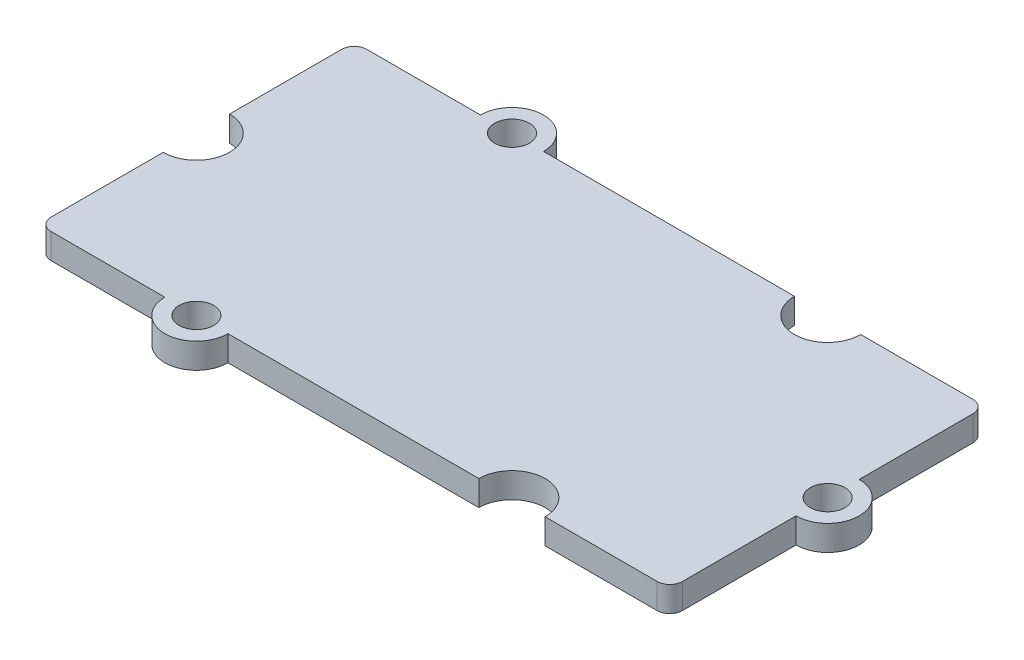
ISO-10303-21;
HEADER;
FILE_DESCRIPTION(('STEP AP214'),'2;1');
FILE_NAME('part.step','',(''),(''),'','','');
FILE_SCHEMA(('AUTOMOTIVE_DESIGN { 1 0 10303 214 1 1 1 1 }'));
ENDSEC;
DATA;
#1=APPLICATION_CONTEXT('core data for automotive mechanical design processes');
#2=APPLICATION_PROTOCOL_DEFINITION('international standard','automotive_design',2000,#1);
#3=PRODUCT_CONTEXT('',#1,'mechanical');
#4=PRODUCT('Part','Part','',(#3));
#5=PRODUCT_RELATED_PRODUCT_CATEGORY('part','',(#4));
#6=PRODUCT_DEFINITION_FORMATION('','',#4);
#7=PRODUCT_DEFINITION_CONTEXT('part definition',#1,'design');
#8=PRODUCT_DEFINITION('design','',#6,#7);
#9=PRODUCT_DEFINITION_SHAPE('','',#8);
#10=(LENGTH_UNIT() NAMED_UNIT(*) SI_UNIT(.MILLI.,.METRE.));
#11=(NAMED_UNIT(*) PLANE_ANGLE_UNIT() SI_UNIT($,.RADIAN.));
#12=(NAMED_UNIT(*) SI_UNIT($,.STERADIAN.) SOLID_ANGLE_UNIT());
#13=UNCERTAINTY_MEASURE_WITH_UNIT(LENGTH_MEASURE(1.E-05),#10,'distance_accuracy_value','');
#14=(GEOMETRIC_REPRESENTATION_CONTEXT(3) GLOBAL_UNCERTAINTY_ASSIGNED_CONTEXT((#13)) GLOBAL_UNIT_ASSIGNED_CONTEXT((#10,
#11,#12)) REPRESENTATION_CONTEXT('',''));
#15=CARTESIAN_POINT('',(0.,0.,0.));
#16=DIRECTION('',(0.,0.,1.));
#17=DIRECTION('',(1.,0.,0.));
#18=AXIS2_PLACEMENT_3D('',#15,#16,#17);
#19=CARTESIAN_POINT('',(20.,0.8,0.));
#20=DIRECTION('',(0.,-1.,0.));
#21=DIRECTION('',(0.,0.,-1.));
#22=AXIS2_PLACEMENT_3D('',#19,#20,#21);
#23=CYLINDRICAL_SURFACE('',#22,2.);
#24=CARTESIAN_POINT('',(20.,-0.8,0.));
#25=DIRECTION('',(0.,1.,0.));
#26=DIRECTION('',(0.,0.,1.));
#27=AXIS2_PLACEMENT_3D('',#24,#25,#26);
#28=CIRCLE('',#27,2.);
#29=CARTESIAN_POINT('',(20.,-0.8,2.00000000000001));
#30=VERTEX_POINT('',#29);
#31=CARTESIAN_POINT('',(20.,-0.8,-2.));
#32=VERTEX_POINT('',#31);
#33=EDGE_CURVE('E218',#30,#32,#28,.T.);
#34=ORIENTED_EDGE('',*,*,#33,.T.);
#35=DIRECTION('',(0.,-1.,0.));
#36=VECTOR('',#35,1.);
#37=CARTESIAN_POINT('',(20.,0.8,-2.));
#38=LINE('',#37,#36);
#39=CARTESIAN_POINT('',(20.,0.8,-2.));
#40=VERTEX_POINT('',#39);
#41=EDGE_CURVE('E11',#40,#32,#38,.T.);
#42=ORIENTED_EDGE('',*,*,#41,.F.);
#43=CARTESIAN_POINT('',(20.,0.8,0.));
#44=DIRECTION('',(0.,1.,0.));
#45=DIRECTION('',(0.,0.,1.));
#46=AXIS2_PLACEMENT_3D('',#43,#44,#45);
#47=CIRCLE('',#46,2.);
#48=CARTESIAN_POINT('',(20.,0.8,2.00000000000001));
#49=VERTEX_POINT('',#48);
#50=EDGE_CURVE('E269',#49,#40,#47,.T.);
#51=ORIENTED_EDGE('',*,*,#50,.F.);
#52=DIRECTION('',(0.,-1.,0.));
#53=VECTOR('',#52,1.);
#54=CARTESIAN_POINT('',(20.,0.8,2.00000000000001));
#55=LINE('',#54,#53);
#56=EDGE_CURVE('E217',#49,#30,#55,.T.);
#57=ORIENTED_EDGE('',*,*,#56,.T.);
#58=EDGE_LOOP('',(#34,#42,#51,#57));
#59=FACE_BOUND('',#58,.T.);
#60=ADVANCED_FACE('F38',(#59),#23,.T.);
#61=CARTESIAN_POINT('',(20.,0.8,0.));
#62=DIRECTION('',(-1.,0.,0.));
#63=DIRECTION('',(0.,0.,1.));
#64=AXIS2_PLACEMENT_3D('',#61,#62,#63);
#65=PLANE('',#64);
#66=DIRECTION('',(0.,0.,-1.));
#67=VECTOR('',#66,1.);
#68=CARTESIAN_POINT('',(20.,-0.8,0.));
#69=LINE('',#68,#67);
#70=CARTESIAN_POINT('',(20.,-0.8,-9.19999999999999));
#71=VERTEX_POINT('',#70);
#72=EDGE_CURVE('E221',#32,#71,#69,.T.);
#73=ORIENTED_EDGE('',*,*,#72,.T.);
#74=DIRECTION('',(0.,-1.,0.));
#75=VECTOR('',#74,1.);
#76=CARTESIAN_POINT('',(20.,0.8,-9.19999999999999));
#77=LINE('',#76,#75);
#78=CARTESIAN_POINT('',(20.,0.8,-9.19999999999999));
#79=VERTEX_POINT('',#78);
#80=EDGE_CURVE('E46',#79,#71,#77,.T.);
#81=ORIENTED_EDGE('',*,*,#80,.F.);
#82=DIRECTION('',(0.,0.,-1.));
#83=VECTOR('',#82,1.);
#84=CARTESIAN_POINT('',(20.,0.8,0.));
#85=LINE('',#84,#83);
#86=EDGE_CURVE('E133',#40,#79,#85,.T.);
#87=ORIENTED_EDGE('',*,*,#86,.F.);
#88=ORIENTED_EDGE('',*,*,#41,.T.);
#89=EDGE_LOOP('',(#73,#81,#87,#88));
#90=FACE_BOUND('',#89,.T.);
#91=ADVANCED_FACE('F308',(#90),#65,.F.);
#92=CARTESIAN_POINT('',(19.2,0.8,-9.19999999999999));
#93=DIRECTION('',(0.,-1.,0.));
#94=DIRECTION('',(0.,0.,-1.));
#95=AXIS2_PLACEMENT_3D('',#92,#93,#94);
#96=CYLINDRICAL_SURFACE('',#95,0.800000000000002);
#97=CARTESIAN_POINT('',(19.2,-0.8,-9.19999999999999));
#98=DIRECTION('',(0.,1.,0.));
#99=DIRECTION('',(0.,0.,1.));
#100=AXIS2_PLACEMENT_3D('',#97,#98,#99);
#101=CIRCLE('',#100,0.800000000000002);
#102=CARTESIAN_POINT('',(19.2,-0.8,-9.99999999999999));
#103=VERTEX_POINT('',#102);
#104=EDGE_CURVE('E224',#103,#71,#101,.F.);
#105=ORIENTED_EDGE('',*,*,#104,.F.);
#106=DIRECTION('',(0.,-1.,0.));
#107=VECTOR('',#106,1.);
#108=CARTESIAN_POINT('',(19.2,0.8,-9.99999999999999));
#109=LINE('',#108,#107);
#110=CARTESIAN_POINT('',(19.2,0.8,-9.99999999999999));
#111=VERTEX_POINT('',#110);
#112=EDGE_CURVE('E301',#111,#103,#109,.T.);
#113=ORIENTED_EDGE('',*,*,#112,.F.);
#114=CARTESIAN_POINT('',(19.2,0.8,-9.19999999999999));
#115=DIRECTION('',(0.,1.,0.));
#116=DIRECTION('',(0.,0.,1.));
#117=AXIS2_PLACEMENT_3D('',#114,#115,#116);
#118=CIRCLE('',#117,0.800000000000002);
#119=EDGE_CURVE('E307',#111,#79,#118,.F.);
#120=ORIENTED_EDGE('',*,*,#119,.T.);
#121=ORIENTED_EDGE('',*,*,#80,.T.);
#122=EDGE_LOOP('',(#105,#113,#120,#121));
#123=FACE_BOUND('',#122,.T.);
#124=ADVANCED_FACE('F305',(#123),#96,.T.);
#125=CARTESIAN_POINT('',(0.,0.8,-9.99999999999999));
#126=DIRECTION('',(0.,0.,-1.));
#127=DIRECTION('',(-1.,0.,0.));
#128=AXIS2_PLACEMENT_3D('',#125,#126,#127);
#129=PLANE('',#128);
#130=DIRECTION('',(1.,0.,0.));
#131=VECTOR('',#130,1.);
#132=CARTESIAN_POINT('',(0.,-0.8,-9.99999999999999));
#133=LINE('',#132,#131);
#134=CARTESIAN_POINT('',(12.1,-0.8,-9.99999999999999));
#135=VERTEX_POINT('',#134);
#136=EDGE_CURVE('E227',#135,#103,#133,.T.);
#137=ORIENTED_EDGE('',*,*,#136,.F.);
#138=DIRECTION('',(0.,-1.,0.));
#139=VECTOR('',#138,1.);
#140=CARTESIAN_POINT('',(12.1,0.8,-9.99999999999999));
#141=LINE('',#140,#139);
#142=CARTESIAN_POINT('',(12.1,0.8,-9.99999999999999));
#143=VERTEX_POINT('',#142);
#144=EDGE_CURVE('E299',#143,#135,#141,.T.);
#145=ORIENTED_EDGE('',*,*,#144,.F.);
#146=DIRECTION('',(1.,0.,0.));
#147=VECTOR('',#146,1.);
#148=CARTESIAN_POINT('',(0.,0.8,-9.99999999999999));
#149=LINE('',#148,#147);
#150=EDGE_CURVE('E321',#143,#111,#149,.T.);
#151=ORIENTED_EDGE('',*,*,#150,.T.);
#152=ORIENTED_EDGE('',*,*,#112,.T.);
#153=EDGE_LOOP('',(#137,#145,#151,#152));
#154=FACE_BOUND('',#153,.T.);
#155=ADVANCED_FACE('F318',(#154),#129,.T.);
#156=CARTESIAN_POINT('',(10.,0.8,-9.99999999999999));
#157=DIRECTION('',(0.,-1.,0.));
#158=DIRECTION('',(0.,0.,-1.));
#159=AXIS2_PLACEMENT_3D('',#156,#157,#158);
#160=CYLINDRICAL_SURFACE('',#159,2.1);
#161=CARTESIAN_POINT('',(10.,-0.8,-9.99999999999999));
#162=DIRECTION('',(0.,1.,0.));
#163=DIRECTION('',(0.,0.,1.));
#164=AXIS2_PLACEMENT_3D('',#161,#162,#163);
#165=CIRCLE('',#164,2.1);
#166=CARTESIAN_POINT('',(7.9,-0.8,-9.99999999999999));
#167=VERTEX_POINT('',#166);
#168=EDGE_CURVE('E230',#167,#135,#165,.T.);
#169=ORIENTED_EDGE('',*,*,#168,.F.);
#170=DIRECTION('',(0.,-1.,0.));
#171=VECTOR('',#170,1.);
#172=CARTESIAN_POINT('',(7.9,0.8,-9.99999999999999));
#173=LINE('',#172,#171);
#174=CARTESIAN_POINT('',(7.9,0.8,-9.99999999999999));
#175=VERTEX_POINT('',#174);
#176=EDGE_CURVE('E297',#175,#167,#173,.T.);
#177=ORIENTED_EDGE('',*,*,#176,.F.);
#178=CARTESIAN_POINT('',(10.,0.8,-9.99999999999999));
#179=DIRECTION('',(0.,1.,0.));
#180=DIRECTION('',(0.,0.,1.));
#181=AXIS2_PLACEMENT_3D('',#178,#179,#180);
#182=CIRCLE('',#181,2.1);
#183=EDGE_CURVE('E325',#175,#143,#182,.T.);
#184=ORIENTED_EDGE('',*,*,#183,.T.);
#185=ORIENTED_EDGE('',*,*,#144,.T.);
#186=EDGE_LOOP('',(#169,#177,#184,#185));
#187=FACE_BOUND('',#186,.T.);
#188=ADVANCED_FACE('F403',(#187),#160,.F.);
#189=CARTESIAN_POINT('',(-8.,-0.8,-9.99999999999999));
#190=VERTEX_POINT('',#189);
#191=EDGE_CURVE('E232',#190,#167,#133,.T.);
#192=ORIENTED_EDGE('',*,*,#191,.F.);
#193=DIRECTION('',(0.,-1.,0.));
#194=VECTOR('',#193,1.);
#195=CARTESIAN_POINT('',(-8.,0.8,-9.99999999999999));
#196=LINE('',#195,#194);
#197=CARTESIAN_POINT('',(-8.,0.8,-9.99999999999999));
#198=VERTEX_POINT('',#197);
#199=EDGE_CURVE('E295',#198,#190,#196,.T.);
#200=ORIENTED_EDGE('',*,*,#199,.F.);
#201=EDGE_CURVE('E328',#198,#175,#149,.T.);
#202=ORIENTED_EDGE('',*,*,#201,.T.);
#203=ORIENTED_EDGE('',*,*,#176,.T.);
#204=EDGE_LOOP('',(#192,#200,#202,#203));
#205=FACE_BOUND('',#204,.T.);
#206=ADVANCED_FACE('F398',(#205),#129,.T.);
#207=CARTESIAN_POINT('',(-10.,0.8,-9.99999999999999));
#208=DIRECTION('',(0.,-1.,0.));
#209=DIRECTION('',(0.,0.,-1.));
#210=AXIS2_PLACEMENT_3D('',#207,#208,#209);
#211=CYLINDRICAL_SURFACE('',#210,2.);
#212=CARTESIAN_POINT('',(-10.,-0.8,-9.99999999999999));
#213=DIRECTION('',(0.,1.,0.));
#214=DIRECTION('',(0.,0.,1.));
#215=AXIS2_PLACEMENT_3D('',#212,#213,#214);
#216=CIRCLE('',#215,2.);
#217=CARTESIAN_POINT('',(-12.,-0.8,-9.99999999999999));
#218=VERTEX_POINT('',#217);
#219=EDGE_CURVE('E235',#190,#218,#216,.T.);
#220=ORIENTED_EDGE('',*,*,#219,.T.);
#221=DIRECTION('',(0.,-1.,0.));
#222=VECTOR('',#221,1.);
#223=CARTESIAN_POINT('',(-12.,0.8,-9.99999999999999));
#224=LINE('',#223,#222);
#225=CARTESIAN_POINT('',(-12.,0.8,-9.99999999999999));
#226=VERTEX_POINT('',#225);
#227=EDGE_CURVE('E293',#226,#218,#224,.T.);
#228=ORIENTED_EDGE('',*,*,#227,.F.);
#229=CARTESIAN_POINT('',(-10.,0.8,-9.99999999999999));
#230=DIRECTION('',(0.,1.,0.));
#231=DIRECTION('',(0.,0.,1.));
#232=AXIS2_PLACEMENT_3D('',#229,#230,#231);
#233=CIRCLE('',#232,2.);
#234=EDGE_CURVE('E332',#198,#226,#233,.T.);
#235=ORIENTED_EDGE('',*,*,#234,.F.);
#236=ORIENTED_EDGE('',*,*,#199,.T.);
#237=EDGE_LOOP('',(#220,#228,#235,#236));
#238=FACE_BOUND('',#237,.T.);
#239=ADVANCED_FACE('F405',(#238),#211,.T.);
#240=CARTESIAN_POINT('',(-19.2,-0.8,-9.99999999999999));
#241=VERTEX_POINT('',#240);
#242=EDGE_CURVE('E231',#241,#218,#133,.T.);
#243=ORIENTED_EDGE('',*,*,#242,.F.);
#244=DIRECTION('',(0.,-1.,0.));
#245=VECTOR('',#244,1.);
#246=CARTESIAN_POINT('',(-19.2,0.8,-9.99999999999999));
#247=LINE('',#246,#245);
#248=CARTESIAN_POINT('',(-19.2,0.8,-9.99999999999999));
#249=VERTEX_POINT('',#248);
#250=EDGE_CURVE('E291',#249,#241,#247,.T.);
#251=ORIENTED_EDGE('',*,*,#250,.F.);
#252=EDGE_CURVE('E327',#249,#226,#149,.T.);
#253=ORIENTED_EDGE('',*,*,#252,.T.);
#254=ORIENTED_EDGE('',*,*,#227,.T.);
#255=EDGE_LOOP('',(#243,#251,#253,#254));
#256=FACE_BOUND('',#255,.T.);
#257=ADVANCED_FACE('F394',(#256),#129,.T.);
#258=CARTESIAN_POINT('',(-19.2,0.8,-9.19999999999999));
#259=DIRECTION('',(0.,-1.,0.));
#260=DIRECTION('',(0.,0.,-1.));
#261=AXIS2_PLACEMENT_3D('',#258,#259,#260);
#262=CYLINDRICAL_SURFACE('',#261,0.8);
#263=CARTESIAN_POINT('',(-19.2,-0.8,-9.19999999999999));
#264=DIRECTION('',(0.,1.,0.));
#265=DIRECTION('',(0.,0.,1.));
#266=AXIS2_PLACEMENT_3D('',#263,#264,#265);
#267=CIRCLE('',#266,0.8);
#268=CARTESIAN_POINT('',(-20.,-0.8,-9.19999999999999));
#269=VERTEX_POINT('',#268);
#270=EDGE_CURVE('E238',#269,#241,#267,.F.);
#271=ORIENTED_EDGE('',*,*,#270,.F.);
#272=DIRECTION('',(0.,-1.,0.));
#273=VECTOR('',#272,1.);
#274=CARTESIAN_POINT('',(-20.,0.8,-9.19999999999999));
#275=LINE('',#274,#273);
#276=CARTESIAN_POINT('',(-20.,0.8,-9.19999999999999));
#277=VERTEX_POINT('',#276);
#278=EDGE_CURVE('E289',#277,#269,#275,.T.);
#279=ORIENTED_EDGE('',*,*,#278,.F.);
#280=CARTESIAN_POINT('',(-19.2,0.8,-9.19999999999999));
#281=DIRECTION('',(0.,1.,0.));
#282=DIRECTION('',(0.,0.,1.));
#283=AXIS2_PLACEMENT_3D('',#280,#281,#282);
#284=CIRCLE('',#283,0.8);
#285=EDGE_CURVE('E334',#277,#249,#284,.F.);
#286=ORIENTED_EDGE('',*,*,#285,.T.);
#287=ORIENTED_EDGE('',*,*,#250,.T.);
#288=EDGE_LOOP('',(#271,#279,#286,#287));
#289=FACE_BOUND('',#288,.T.);
#290=ADVANCED_FACE('F389',(#289),#262,.T.);
#291=CARTESIAN_POINT('',(-20.,0.8,0.));
#292=DIRECTION('',(-1.,0.,0.));
#293=DIRECTION('',(0.,0.,1.));
#294=AXIS2_PLACEMENT_3D('',#291,#292,#293);
#295=PLANE('',#294);
#296=DIRECTION('',(0.,0.,-1.));
#297=VECTOR('',#296,1.);
#298=CARTESIAN_POINT('',(-20.,-0.8,0.));
#299=LINE('',#298,#297);
#300=CARTESIAN_POINT('',(-20.,-0.8,-2.09999999999999));
#301=VERTEX_POINT('',#300);
#302=EDGE_CURVE('E241',#301,#269,#299,.T.);
#303=ORIENTED_EDGE('',*,*,#302,.F.);
#304=DIRECTION('',(0.,-1.,0.));
#305=VECTOR('',#304,1.);
#306=CARTESIAN_POINT('',(-20.,0.8,-2.09999999999999));
#307=LINE('',#306,#305);
#308=CARTESIAN_POINT('',(-20.,0.8,-2.09999999999999));
#309=VERTEX_POINT('',#308);
#310=EDGE_CURVE('E287',#309,#301,#307,.T.);
#311=ORIENTED_EDGE('',*,*,#310,.F.);
#312=DIRECTION('',(0.,0.,-1.));
#313=VECTOR('',#312,1.);
#314=CARTESIAN_POINT('',(-20.,0.8,0.));
#315=LINE('',#314,#313);
#316=EDGE_CURVE('E337',#309,#277,#315,.T.);
#317=ORIENTED_EDGE('',*,*,#316,.T.);
#318=ORIENTED_EDGE('',*,*,#278,.T.);
#319=EDGE_LOOP('',(#303,#311,#317,#318));
#320=FACE_BOUND('',#319,.T.);
#321=ADVANCED_FACE('F383',(#320),#295,.T.);
#322=CARTESIAN_POINT('',(-20.,0.8,0.));
#323=DIRECTION('',(0.,-1.,0.));
#324=DIRECTION('',(0.,0.,-1.));
#325=AXIS2_PLACEMENT_3D('',#322,#323,#324);
#326=CYLINDRICAL_SURFACE('',#325,2.1);
#327=CARTESIAN_POINT('',(-20.,-0.8,0.));
#328=DIRECTION('',(0.,1.,0.));
#329=DIRECTION('',(0.,0.,1.));
#330=AXIS2_PLACEMENT_3D('',#327,#328,#329);
#331=CIRCLE('',#330,2.1);
#332=CARTESIAN_POINT('',(-20.,-0.8,2.10000000000001));
#333=VERTEX_POINT('',#332);
#334=EDGE_CURVE('E244',#333,#301,#331,.T.);
#335=ORIENTED_EDGE('',*,*,#334,.F.);
#336=DIRECTION('',(0.,-1.,0.));
#337=VECTOR('',#336,1.);
#338=CARTESIAN_POINT('',(-20.,0.8,2.10000000000001));
#339=LINE('',#338,#337);
#340=CARTESIAN_POINT('',(-20.,0.8,2.10000000000001));
#341=VERTEX_POINT('',#340);
#342=EDGE_CURVE('E285',#341,#333,#339,.T.);
#343=ORIENTED_EDGE('',*,*,#342,.F.);
#344=CARTESIAN_POINT('',(-20.,0.8,0.));
#345=DIRECTION('',(0.,1.,0.));
#346=DIRECTION('',(0.,0.,1.));
#347=AXIS2_PLACEMENT_3D('',#344,#345,#346);
#348=CIRCLE('',#347,2.1);
#349=EDGE_CURVE('E340',#341,#309,#348,.T.);
#350=ORIENTED_EDGE('',*,*,#349,.T.);
#351=ORIENTED_EDGE('',*,*,#310,.T.);
#352=EDGE_LOOP('',(#335,#343,#350,#351));
#353=FACE_BOUND('',#352,.T.);
#354=ADVANCED_FACE('F379',(#353),#326,.F.);
#355=CARTESIAN_POINT('',(-20.,-0.8,9.20000000000001));
#356=VERTEX_POINT('',#355);
#357=EDGE_CURVE('E245',#356,#333,#299,.T.);
#358=ORIENTED_EDGE('',*,*,#357,.F.);
#359=DIRECTION('',(0.,-1.,0.));
#360=VECTOR('',#359,1.);
#361=CARTESIAN_POINT('',(-20.,0.8,9.20000000000001));
#362=LINE('',#361,#360);
#363=CARTESIAN_POINT('',(-20.,0.8,9.20000000000001));
#364=VERTEX_POINT('',#363);
#365=EDGE_CURVE('E283',#364,#356,#362,.T.);
#366=ORIENTED_EDGE('',*,*,#365,.F.);
#367=EDGE_CURVE('E341',#364,#341,#315,.T.);
#368=ORIENTED_EDGE('',*,*,#367,.T.);
#369=ORIENTED_EDGE('',*,*,#342,.T.);
#370=EDGE_LOOP('',(#358,#366,#368,#369));
#371=FACE_BOUND('',#370,.T.);
#372=ADVANCED_FACE('F374',(#371),#295,.T.);
#373=CARTESIAN_POINT('',(-19.2,0.8,9.20000000000001));
#374=DIRECTION('',(0.,-1.,0.));
#375=DIRECTION('',(0.,0.,-1.));
#376=AXIS2_PLACEMENT_3D('',#373,#374,#375);
#377=CYLINDRICAL_SURFACE('',#376,0.8);
#378=CARTESIAN_POINT('',(-19.2,-0.8,9.20000000000001));
#379=DIRECTION('',(0.,1.,0.));
#380=DIRECTION('',(0.,0.,1.));
#381=AXIS2_PLACEMENT_3D('',#378,#379,#380);
#382=CIRCLE('',#381,0.8);
#383=CARTESIAN_POINT('',(-19.2,-0.8,10.));
#384=VERTEX_POINT('',#383);
#385=EDGE_CURVE('E248',#384,#356,#382,.F.);
#386=ORIENTED_EDGE('',*,*,#385,.F.);
#387=DIRECTION('',(0.,-1.,0.));
#388=VECTOR('',#387,1.);
#389=CARTESIAN_POINT('',(-19.2,0.8,10.));
#390=LINE('',#389,#388);
#391=CARTESIAN_POINT('',(-19.2,0.8,10.));
#392=VERTEX_POINT('',#391);
#393=EDGE_CURVE('E281',#392,#384,#390,.T.);
#394=ORIENTED_EDGE('',*,*,#393,.F.);
#395=CARTESIAN_POINT('',(-19.2,0.8,9.20000000000001));
#396=DIRECTION('',(0.,1.,0.));
#397=DIRECTION('',(0.,0.,1.));
#398=AXIS2_PLACEMENT_3D('',#395,#396,#397);
#399=CIRCLE('',#398,0.8);
#400=EDGE_CURVE('E344',#392,#364,#399,.F.);
#401=ORIENTED_EDGE('',*,*,#400,.T.);
#402=ORIENTED_EDGE('',*,*,#365,.T.);
#403=EDGE_LOOP('',(#386,#394,#401,#402));
#404=FACE_BOUND('',#403,.T.);
#405=ADVANCED_FACE('F369',(#404),#377,.T.);
#406=CARTESIAN_POINT('',(0.,0.8,10.));
#407=DIRECTION('',(0.,0.,-1.));
#408=DIRECTION('',(-1.,0.,0.));
#409=AXIS2_PLACEMENT_3D('',#406,#407,#408);
#410=PLANE('',#409);
#411=DIRECTION('',(1.,0.,0.));
#412=VECTOR('',#411,1.);
#413=CARTESIAN_POINT('',(0.,-0.8,10.));
#414=LINE('',#413,#412);
#415=CARTESIAN_POINT('',(-12.,-0.8,10.));
#416=VERTEX_POINT('',#415);
#417=EDGE_CURVE('E251',#384,#416,#414,.T.);
#418=ORIENTED_EDGE('',*,*,#417,.T.);
#419=DIRECTION('',(0.,-1.,0.));
#420=VECTOR('',#419,1.);
#421=CARTESIAN_POINT('',(-12.,0.8,10.));
#422=LINE('',#421,#420);
#423=CARTESIAN_POINT('',(-12.,0.8,10.));
#424=VERTEX_POINT('',#423);
#425=EDGE_CURVE('E278',#424,#416,#422,.T.);
#426=ORIENTED_EDGE('',*,*,#425,.F.);
#427=DIRECTION('',(1.,0.,0.));
#428=VECTOR('',#427,1.);
#429=CARTESIAN_POINT('',(0.,0.8,10.));
#430=LINE('',#429,#428);
#431=EDGE_CURVE('E194',#392,#424,#430,.T.);
#432=ORIENTED_EDGE('',*,*,#431,.F.);
#433=ORIENTED_EDGE('',*,*,#393,.T.);
#434=EDGE_LOOP('',(#418,#426,#432,#433));
#435=FACE_BOUND('',#434,.T.);
#436=ADVANCED_FACE('F366',(#435),#410,.F.);
#437=CARTESIAN_POINT('',(-10.,0.8,10.));
#438=DIRECTION('',(0.,-1.,0.));
#439=DIRECTION('',(0.,0.,-1.));
#440=AXIS2_PLACEMENT_3D('',#437,#438,#439);
#441=CYLINDRICAL_SURFACE('',#440,2.);
#442=CARTESIAN_POINT('',(-10.,-0.8,10.));
#443=DIRECTION('',(0.,1.,0.));
#444=DIRECTION('',(0.,0.,1.));
#445=AXIS2_PLACEMENT_3D('',#442,#443,#444);
#446=CIRCLE('',#445,2.);
#447=CARTESIAN_POINT('',(-8.,-0.8,10.));
#448=VERTEX_POINT('',#447);
#449=EDGE_CURVE('E253',#416,#448,#446,.T.);
#450=ORIENTED_EDGE('',*,*,#449,.T.);
#451=DIRECTION('',(0.,-1.,0.));
#452=VECTOR('',#451,1.);
#453=CARTESIAN_POINT('',(-8.,0.8,10.));
#454=LINE('',#453,#452);
#455=CARTESIAN_POINT('',(-8.,0.8,10.));
#456=VERTEX_POINT('',#455);
#457=EDGE_CURVE('E275',#456,#448,#454,.T.);
#458=ORIENTED_EDGE('',*,*,#457,.F.);
#459=CARTESIAN_POINT('',(-10.,0.8,10.));
#460=DIRECTION('',(0.,1.,0.));
#461=DIRECTION('',(0.,0.,1.));
#462=AXIS2_PLACEMENT_3D('',#459,#460,#461);
#463=CIRCLE('',#462,2.);
#464=EDGE_CURVE('E346',#424,#456,#463,.T.);
#465=ORIENTED_EDGE('',*,*,#464,.F.);
#466=ORIENTED_EDGE('',*,*,#425,.T.);
#467=EDGE_LOOP('',(#450,#458,#465,#466));
#468=FACE_BOUND('',#467,.T.);
#469=ADVANCED_FACE('F362',(#468),#441,.T.);
#470=CARTESIAN_POINT('',(7.9,-0.8,10.));
#471=VERTEX_POINT('',#470);
#472=EDGE_CURVE('E254',#448,#471,#414,.T.);
#473=ORIENTED_EDGE('',*,*,#472,.T.);
#474=DIRECTION('',(0.,-1.,0.));
#475=VECTOR('',#474,1.);
#476=CARTESIAN_POINT('',(7.9,0.8,10.));
#477=LINE('',#476,#475);
#478=CARTESIAN_POINT('',(7.9,0.8,10.));
#479=VERTEX_POINT('',#478);
#480=EDGE_CURVE('E273',#479,#471,#477,.T.);
#481=ORIENTED_EDGE('',*,*,#480,.F.);
#482=EDGE_CURVE('E193',#456,#479,#430,.T.);
#483=ORIENTED_EDGE('',*,*,#482,.F.);
#484=ORIENTED_EDGE('',*,*,#457,.T.);
#485=EDGE_LOOP('',(#473,#481,#483,#484));
#486=FACE_BOUND('',#485,.T.);
#487=ADVANCED_FACE('F357',(#486),#410,.F.);
#488=CARTESIAN_POINT('',(10.,0.8,10.));
#489=DIRECTION('',(0.,-1.,0.));
#490=DIRECTION('',(0.,0.,-1.));
#491=AXIS2_PLACEMENT_3D('',#488,#489,#490);
#492=CYLINDRICAL_SURFACE('',#491,2.1);
#493=CARTESIAN_POINT('',(10.,-0.8,10.));
#494=DIRECTION('',(0.,1.,0.));
#495=DIRECTION('',(0.,0.,1.));
#496=AXIS2_PLACEMENT_3D('',#493,#494,#495);
#497=CIRCLE('',#496,2.1);
#498=CARTESIAN_POINT('',(12.1,-0.8,10.));
#499=VERTEX_POINT('',#498);
#500=EDGE_CURVE('E256',#499,#471,#497,.T.);
#501=ORIENTED_EDGE('',*,*,#500,.F.);
#502=DIRECTION('',(0.,-1.,0.));
#503=VECTOR('',#502,1.);
#504=CARTESIAN_POINT('',(12.1,0.8,10.));
#505=LINE('',#504,#503);
#506=CARTESIAN_POINT('',(12.1,0.8,10.));
#507=VERTEX_POINT('',#506);
#508=EDGE_CURVE('E199',#507,#499,#505,.T.);
#509=ORIENTED_EDGE('',*,*,#508,.F.);
#510=CARTESIAN_POINT('',(10.,0.8,10.));
#511=DIRECTION('',(0.,1.,0.));
#512=DIRECTION('',(0.,0.,1.));
#513=AXIS2_PLACEMENT_3D('',#510,#511,#512);
#514=CIRCLE('',#513,2.1);
#515=EDGE_CURVE('E190',#507,#479,#514,.T.);
#516=ORIENTED_EDGE('',*,*,#515,.T.);
#517=ORIENTED_EDGE('',*,*,#480,.T.);
#518=EDGE_LOOP('',(#501,#509,#516,#517));
#519=FACE_BOUND('',#518,.T.);
#520=ADVANCED_FACE('F353',(#519),#492,.F.);
#521=CARTESIAN_POINT('',(19.2,-0.8,10.));
#522=VERTEX_POINT('',#521);
#523=EDGE_CURVE('E198',#499,#522,#414,.T.);
#524=ORIENTED_EDGE('',*,*,#523,.T.);
#525=DIRECTION('',(0.,-1.,0.));
#526=VECTOR('',#525,1.);
#527=CARTESIAN_POINT('',(19.2,0.8,10.));
#528=LINE('',#527,#526);
#529=CARTESIAN_POINT('',(19.2,0.8,10.));
#530=VERTEX_POINT('',#529);
#531=EDGE_CURVE('E195',#530,#522,#528,.T.);
#532=ORIENTED_EDGE('',*,*,#531,.F.);
#533=EDGE_CURVE('E183',#507,#530,#430,.T.);
#534=ORIENTED_EDGE('',*,*,#533,.F.);
#535=ORIENTED_EDGE('',*,*,#508,.T.);
#536=EDGE_LOOP('',(#524,#532,#534,#535));
#537=FACE_BOUND('',#536,.T.);
#538=ADVANCED_FACE('F196',(#537),#410,.F.);
#539=CARTESIAN_POINT('',(19.2,0.8,9.20000000000001));
#540=DIRECTION('',(0.,-1.,0.));
#541=DIRECTION('',(0.,0.,-1.));
#542=AXIS2_PLACEMENT_3D('',#539,#540,#541);
#543=CYLINDRICAL_SURFACE('',#542,0.8);
#544=CARTESIAN_POINT('',(19.2,-0.8,9.20000000000001));
#545=DIRECTION('',(0.,1.,0.));
#546=DIRECTION('',(0.,0.,1.));
#547=AXIS2_PLACEMENT_3D('',#544,#545,#546);
#548=CIRCLE('',#547,0.8);
#549=CARTESIAN_POINT('',(20.,-0.8,9.20000000000001));
#550=VERTEX_POINT('',#549);
#551=EDGE_CURVE('E119',#522,#550,#548,.T.);
#552=ORIENTED_EDGE('',*,*,#551,.T.);
#553=DIRECTION('',(0.,-1.,0.));
#554=VECTOR('',#553,1.);
#555=CARTESIAN_POINT('',(20.,0.8,9.20000000000001));
#556=LINE('',#555,#554);
#557=CARTESIAN_POINT('',(20.,0.8,9.20000000000001));
#558=VERTEX_POINT('',#557);
#559=EDGE_CURVE('E200',#558,#550,#556,.T.);
#560=ORIENTED_EDGE('',*,*,#559,.F.);
#561=CARTESIAN_POINT('',(19.2,0.8,9.20000000000001));
#562=DIRECTION('',(0.,1.,0.));
#563=DIRECTION('',(0.,0.,1.));
#564=AXIS2_PLACEMENT_3D('',#561,#562,#563);
#565=CIRCLE('',#564,0.8);
#566=EDGE_CURVE('E188',#530,#558,#565,.T.);
#567=ORIENTED_EDGE('',*,*,#566,.F.);
#568=ORIENTED_EDGE('',*,*,#531,.T.);
#569=EDGE_LOOP('',(#552,#560,#567,#568));
#570=FACE_BOUND('',#569,.T.);
#571=ADVANCED_FACE('F202',(#570),#543,.T.);
#572=CARTESIAN_POINT('',(20.,0.8,0.));
#573=DIRECTION('',(0.,-1.,0.));
#574=DIRECTION('',(0.,0.,-1.));
#575=AXIS2_PLACEMENT_3D('',#572,#573,#574);
#576=CYLINDRICAL_SURFACE('',#575,1.1);
#577=CARTESIAN_POINT('',(20.,0.8,0.));
#578=DIRECTION('',(0.,1.,0.));
#579=DIRECTION('',(0.,0.,1.));
#580=AXIS2_PLACEMENT_3D('',#577,#578,#579);
#581=CIRCLE('',#580,1.1);
#582=CARTESIAN_POINT('',(20.,0.8,1.1));
#583=VERTEX_POINT('',#582);
#584=EDGE_CURVE('E211',#583,#583,#581,.T.);
#585=ORIENTED_EDGE('',*,*,#584,.T.);
#586=EDGE_LOOP('',(#585));
#587=FACE_BOUND('',#586,.T.);
#588=CARTESIAN_POINT('',(20.,-0.8,0.));
#589=DIRECTION('',(0.,1.,0.));
#590=DIRECTION('',(0.,0.,1.));
#591=AXIS2_PLACEMENT_3D('',#588,#589,#590);
#592=CIRCLE('',#591,1.1);
#593=CARTESIAN_POINT('',(20.,-0.8,1.1));
#594=VERTEX_POINT('',#593);
#595=EDGE_CURVE('E263',#594,#594,#592,.T.);
#596=ORIENTED_EDGE('',*,*,#595,.F.);
#597=EDGE_LOOP('',(#596));
#598=FACE_BOUND('',#597,.T.);
#599=ADVANCED_FACE('F431',(#587,#598),#576,.F.);
#600=CARTESIAN_POINT('',(-10.,0.8,-9.99999999999999));
#601=DIRECTION('',(0.,-1.,0.));
#602=DIRECTION('',(0.,0.,-1.));
#603=AXIS2_PLACEMENT_3D('',#600,#601,#602);
#604=CYLINDRICAL_SURFACE('',#603,1.1);
#605=CARTESIAN_POINT('',(-10.,0.8,-9.99999999999999));
#606=DIRECTION('',(0.,1.,0.));
#607=DIRECTION('',(0.,0.,1.));
#608=AXIS2_PLACEMENT_3D('',#605,#606,#607);
#609=CIRCLE('',#608,1.1);
#610=CARTESIAN_POINT('',(-10.,0.8,-8.89999999999999));
#611=VERTEX_POINT('',#610);
#612=EDGE_CURVE('E204',#611,#611,#609,.T.);
#613=ORIENTED_EDGE('',*,*,#612,.T.);
#614=EDGE_LOOP('',(#613));
#615=FACE_BOUND('',#614,.T.);
#616=CARTESIAN_POINT('',(-10.,-0.8,-9.99999999999999));
#617=DIRECTION('',(0.,1.,0.));
#618=DIRECTION('',(0.,0.,1.));
#619=AXIS2_PLACEMENT_3D('',#616,#617,#618);
#620=CIRCLE('',#619,1.1);
#621=CARTESIAN_POINT('',(-10.,-0.8,-8.89999999999999));
#622=VERTEX_POINT('',#621);
#623=EDGE_CURVE('E260',#622,#622,#620,.T.);
#624=ORIENTED_EDGE('',*,*,#623,.F.);
#625=EDGE_LOOP('',(#624));
#626=FACE_BOUND('',#625,.T.);
#627=ADVANCED_FACE('F424',(#615,#626),#604,.F.);
#628=EDGE_CURVE('E125',#550,#30,#69,.T.);
#629=ORIENTED_EDGE('',*,*,#628,.T.);
#630=ORIENTED_EDGE('',*,*,#56,.F.);
#631=EDGE_CURVE('E54',#558,#49,#85,.T.);
#632=ORIENTED_EDGE('',*,*,#631,.F.);
#633=ORIENTED_EDGE('',*,*,#559,.T.);
#634=EDGE_LOOP('',(#629,#630,#632,#633));
#635=FACE_BOUND('',#634,.T.);
#636=ADVANCED_FACE('F420',(#635),#65,.F.);
#637=CARTESIAN_POINT('',(-10.,0.8,10.));
#638=DIRECTION('',(0.,-1.,0.));
#639=DIRECTION('',(0.,0.,-1.));
#640=AXIS2_PLACEMENT_3D('',#637,#638,#639);
#641=CYLINDRICAL_SURFACE('',#640,1.1);
#642=CARTESIAN_POINT('',(-10.,0.8,10.));
#643=DIRECTION('',(0.,1.,0.));
#644=DIRECTION('',(0.,0.,1.));
#645=AXIS2_PLACEMENT_3D('',#642,#643,#644);
#646=CIRCLE('',#645,1.1);
#647=CARTESIAN_POINT('',(-10.,0.8,11.1));
#648=VERTEX_POINT('',#647);
#649=EDGE_CURVE('E214',#648,#648,#646,.T.);
#650=ORIENTED_EDGE('',*,*,#649,.T.);
#651=EDGE_LOOP('',(#650));
#652=FACE_BOUND('',#651,.T.);
#653=CARTESIAN_POINT('',(-10.,-0.8,10.));
#654=DIRECTION('',(0.,1.,0.));
#655=DIRECTION('',(0.,0.,1.));
#656=AXIS2_PLACEMENT_3D('',#653,#654,#655);
#657=CIRCLE('',#656,1.1);
#658=CARTESIAN_POINT('',(-10.,-0.8,11.1));
#659=VERTEX_POINT('',#658);
#660=EDGE_CURVE('E266',#659,#659,#657,.T.);
#661=ORIENTED_EDGE('',*,*,#660,.F.);
#662=EDGE_LOOP('',(#661));
#663=FACE_BOUND('',#662,.T.);
#664=ADVANCED_FACE('F423',(#652,#663),#641,.F.);
#665=CARTESIAN_POINT('',(0.,0.8,0.));
#666=DIRECTION('',(0.,1.,0.));
#667=DIRECTION('',(0.,0.,1.));
#668=AXIS2_PLACEMENT_3D('',#665,#666,#667);
#669=PLANE('',#668);
#670=ORIENTED_EDGE('',*,*,#50,.T.);
#671=ORIENTED_EDGE('',*,*,#86,.T.);
#672=ORIENTED_EDGE('',*,*,#119,.F.);
#673=ORIENTED_EDGE('',*,*,#150,.F.);
#674=ORIENTED_EDGE('',*,*,#183,.F.);
#675=ORIENTED_EDGE('',*,*,#201,.F.);
#676=ORIENTED_EDGE('',*,*,#234,.T.);
#677=ORIENTED_EDGE('',*,*,#252,.F.);
#678=ORIENTED_EDGE('',*,*,#285,.F.);
#679=ORIENTED_EDGE('',*,*,#316,.F.);
#680=ORIENTED_EDGE('',*,*,#349,.F.);
#681=ORIENTED_EDGE('',*,*,#367,.F.);
#682=ORIENTED_EDGE('',*,*,#400,.F.);
#683=ORIENTED_EDGE('',*,*,#431,.T.);
#684=ORIENTED_EDGE('',*,*,#464,.T.);
#685=ORIENTED_EDGE('',*,*,#482,.T.);
#686=ORIENTED_EDGE('',*,*,#515,.F.);
#687=ORIENTED_EDGE('',*,*,#533,.T.);
#688=ORIENTED_EDGE('',*,*,#566,.T.);
#689=ORIENTED_EDGE('',*,*,#631,.T.);
#690=EDGE_LOOP('',(#670,#671,#672,#673,#674,#675,#676,#677,#678,#679,#680,#681,#682,#683,#684,
#685,#686,#687,#688,#689));
#691=FACE_BOUND('',#690,.T.);
#692=ORIENTED_EDGE('',*,*,#612,.F.);
#693=EDGE_LOOP('',(#692));
#694=FACE_BOUND('',#693,.T.);
#695=ORIENTED_EDGE('',*,*,#584,.F.);
#696=EDGE_LOOP('',(#695));
#697=FACE_BOUND('',#696,.T.);
#698=ORIENTED_EDGE('',*,*,#649,.F.);
#699=EDGE_LOOP('',(#698));
#700=FACE_BOUND('',#699,.T.);
#701=ADVANCED_FACE('F185',(#691,#694,#697,#700),#669,.T.);
#702=CARTESIAN_POINT('',(0.,-0.8,0.));
#703=DIRECTION('',(0.,1.,0.));
#704=DIRECTION('',(0.,0.,1.));
#705=AXIS2_PLACEMENT_3D('',#702,#703,#704);
#706=PLANE('',#705);
#707=ORIENTED_EDGE('',*,*,#33,.F.);
#708=ORIENTED_EDGE('',*,*,#628,.F.);
#709=ORIENTED_EDGE('',*,*,#551,.F.);
#710=ORIENTED_EDGE('',*,*,#523,.F.);
#711=ORIENTED_EDGE('',*,*,#500,.T.);
#712=ORIENTED_EDGE('',*,*,#472,.F.);
#713=ORIENTED_EDGE('',*,*,#449,.F.);
#714=ORIENTED_EDGE('',*,*,#417,.F.);
#715=ORIENTED_EDGE('',*,*,#385,.T.);
#716=ORIENTED_EDGE('',*,*,#357,.T.);
#717=ORIENTED_EDGE('',*,*,#334,.T.);
#718=ORIENTED_EDGE('',*,*,#302,.T.);
#719=ORIENTED_EDGE('',*,*,#270,.T.);
#720=ORIENTED_EDGE('',*,*,#242,.T.);
#721=ORIENTED_EDGE('',*,*,#219,.F.);
#722=ORIENTED_EDGE('',*,*,#191,.T.);
#723=ORIENTED_EDGE('',*,*,#168,.T.);
#724=ORIENTED_EDGE('',*,*,#136,.T.);
#725=ORIENTED_EDGE('',*,*,#104,.T.);
#726=ORIENTED_EDGE('',*,*,#72,.F.);
#727=EDGE_LOOP('',(#707,#708,#709,#710,#711,#712,#713,#714,#715,#716,#717,#718,#719,#720,#721,
#722,#723,#724,#725,#726));
#728=FACE_BOUND('',#727,.T.);
#729=ORIENTED_EDGE('',*,*,#623,.T.);
#730=EDGE_LOOP('',(#729));
#731=FACE_BOUND('',#730,.T.);
#732=ORIENTED_EDGE('',*,*,#595,.T.);
#733=EDGE_LOOP('',(#732));
#734=FACE_BOUND('',#733,.T.);
#735=ORIENTED_EDGE('',*,*,#660,.T.);
#736=EDGE_LOOP('',(#735));
#737=FACE_BOUND('',#736,.T.);
#738=ADVANCED_FACE('F312',(#728,#731,#734,#737),#706,.F.);
#739=CLOSED_SHELL('',(#60,#91,#124,#155,#188,#206,#239,#257,#290,#321,#354,#372,#405,#436,#469,
#487,#520,#538,#571,#599,#627,#636,#664,#701,#738));
#740=MANIFOLD_SOLID_BREP('B2',#739);
#741=ADVANCED_BREP_SHAPE_REPRESENTATION('',(#18,#740),#14);
#742=SHAPE_DEFINITION_REPRESENTATION(#9,#741);
ENDSEC;
END-ISO-10303-21;
